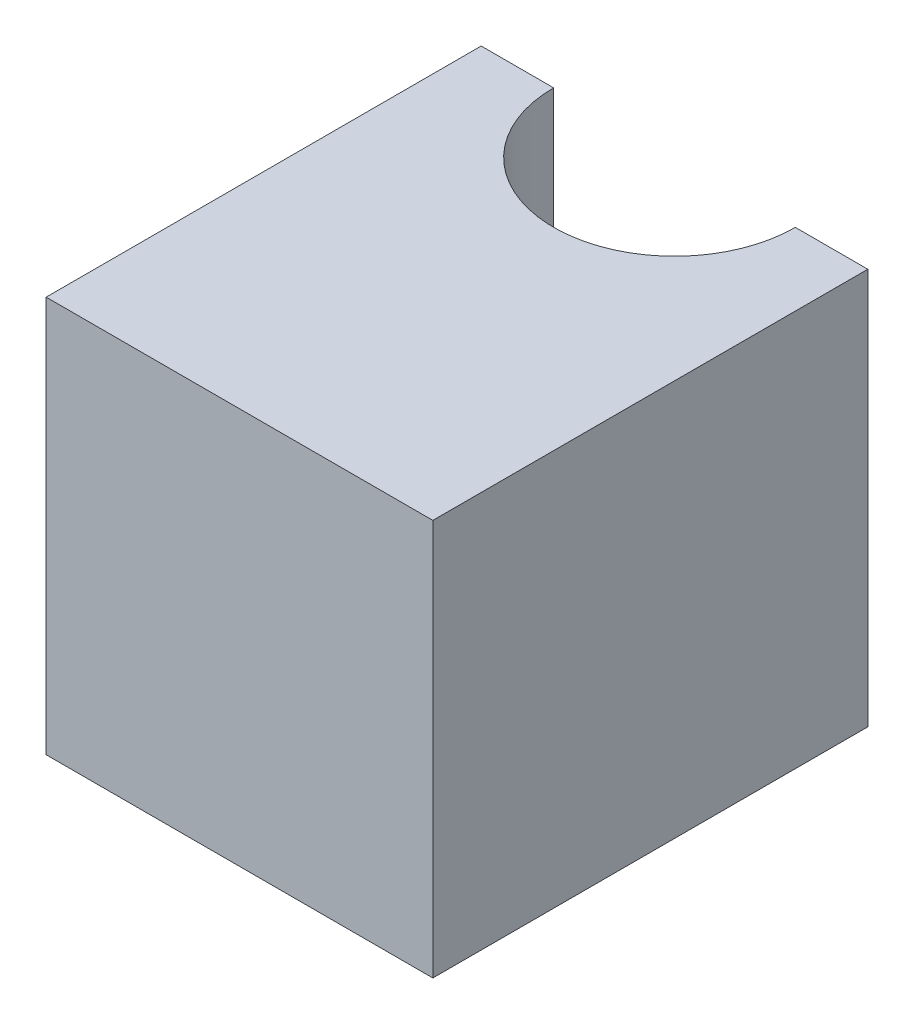
ISO-10303-21;
HEADER;
FILE_DESCRIPTION(('STEP AP214'),'2;1');
FILE_NAME('part.step','',(''),(''),'','','');
FILE_SCHEMA(('AUTOMOTIVE_DESIGN { 1 0 10303 214 1 1 1 1 }'));
ENDSEC;
DATA;
#1=APPLICATION_CONTEXT('core data for automotive mechanical design processes');
#2=APPLICATION_PROTOCOL_DEFINITION('international standard','automotive_design',2000,#1);
#3=PRODUCT_CONTEXT('',#1,'mechanical');
#4=PRODUCT('Part','Part','',(#3));
#5=PRODUCT_RELATED_PRODUCT_CATEGORY('part','',(#4));
#6=PRODUCT_DEFINITION_FORMATION('','',#4);
#7=PRODUCT_DEFINITION_CONTEXT('part definition',#1,'design');
#8=PRODUCT_DEFINITION('design','',#6,#7);
#9=PRODUCT_DEFINITION_SHAPE('','',#8);
#10=(LENGTH_UNIT() NAMED_UNIT(*) SI_UNIT(.MILLI.,.METRE.));
#11=(NAMED_UNIT(*) PLANE_ANGLE_UNIT() SI_UNIT($,.RADIAN.));
#12=(NAMED_UNIT(*) SI_UNIT($,.STERADIAN.) SOLID_ANGLE_UNIT());
#13=UNCERTAINTY_MEASURE_WITH_UNIT(LENGTH_MEASURE(1.E-05),#10,'distance_accuracy_value','');
#14=(GEOMETRIC_REPRESENTATION_CONTEXT(3) GLOBAL_UNCERTAINTY_ASSIGNED_CONTEXT((#13)) GLOBAL_UNIT_ASSIGNED_CONTEXT((#10,
#11,#12)) REPRESENTATION_CONTEXT('',''));
#15=CARTESIAN_POINT('',(0.,0.,0.));
#16=DIRECTION('',(0.,0.,1.));
#17=DIRECTION('',(1.,0.,0.));
#18=AXIS2_PLACEMENT_3D('',#15,#16,#17);
#19=CARTESIAN_POINT('',(-7.,0.,-6.1));
#20=DIRECTION('',(0.,1.,0.));
#21=DIRECTION('',(0.,0.,1.));
#22=AXIS2_PLACEMENT_3D('',#19,#20,#21);
#23=CYLINDRICAL_SURFACE('',#22,0.25);
#24=DIRECTION('',(0.,1.,0.));
#25=VECTOR('',#24,1.);
#26=CARTESIAN_POINT('',(-7.25,0.,-6.1));
#27=LINE('',#26,#25);
#28=CARTESIAN_POINT('',(-7.25,0.82,-6.1));
#29=VERTEX_POINT('',#28);
#30=CARTESIAN_POINT('',(-7.25,0.,-6.1));
#31=VERTEX_POINT('',#30);
#32=EDGE_CURVE('E119',#29,#31,#27,.F.);
#33=ORIENTED_EDGE('',*,*,#32,.F.);
#34=CARTESIAN_POINT('',(-7.,0.82,-6.1));
#35=DIRECTION('',(0.,1.,0.));
#36=DIRECTION('',(0.,0.,1.));
#37=AXIS2_PLACEMENT_3D('',#34,#35,#36);
#38=CIRCLE('',#37,0.25);
#39=CARTESIAN_POINT('',(-6.75,0.82,-6.1));
#40=VERTEX_POINT('',#39);
#41=EDGE_CURVE('E80',#40,#29,#38,.F.);
#42=ORIENTED_EDGE('',*,*,#41,.F.);
#43=DIRECTION('',(0.,1.,0.));
#44=VECTOR('',#43,1.);
#45=CARTESIAN_POINT('',(-6.75,0.,-6.1));
#46=LINE('',#45,#44);
#47=CARTESIAN_POINT('',(-6.75,0.,-6.1));
#48=VERTEX_POINT('',#47);
#49=EDGE_CURVE('E78',#48,#40,#46,.T.);
#50=ORIENTED_EDGE('',*,*,#49,.F.);
#51=CARTESIAN_POINT('',(-7.,0.,-6.1));
#52=DIRECTION('',(0.,1.,0.));
#53=DIRECTION('',(0.,0.,1.));
#54=AXIS2_PLACEMENT_3D('',#51,#52,#53);
#55=CIRCLE('',#54,0.25);
#56=EDGE_CURVE('E20',#48,#31,#55,.F.);
#57=ORIENTED_EDGE('',*,*,#56,.T.);
#58=EDGE_LOOP('',(#33,#42,#50,#57));
#59=FACE_BOUND('',#58,.T.);
#60=ADVANCED_FACE('F17',(#59),#23,.F.);
#61=CARTESIAN_POINT('',(-7.25,0.,-6.1));
#62=DIRECTION('',(0.,0.,-1.));
#63=DIRECTION('',(-1.,0.,0.));
#64=AXIS2_PLACEMENT_3D('',#61,#62,#63);
#65=PLANE('',#64);
#66=DIRECTION('',(1.,0.,0.));
#67=VECTOR('',#66,1.);
#68=CARTESIAN_POINT('',(-7.,0.82,-6.1));
#69=LINE('',#68,#67);
#70=CARTESIAN_POINT('',(-7.4,0.82,-6.1));
#71=VERTEX_POINT('',#70);
#72=EDGE_CURVE('E104',#29,#71,#69,.F.);
#73=ORIENTED_EDGE('',*,*,#72,.F.);
#74=ORIENTED_EDGE('',*,*,#32,.T.);
#75=DIRECTION('',(1.,0.,0.));
#76=VECTOR('',#75,1.);
#77=CARTESIAN_POINT('',(-7.,0.,-6.1));
#78=LINE('',#77,#76);
#79=CARTESIAN_POINT('',(-7.4,0.,-6.1));
#80=VERTEX_POINT('',#79);
#81=EDGE_CURVE('E73',#31,#80,#78,.F.);
#82=ORIENTED_EDGE('',*,*,#81,.T.);
#83=DIRECTION('',(0.,1.,0.));
#84=VECTOR('',#83,1.);
#85=CARTESIAN_POINT('',(-7.4,0.,-6.1));
#86=LINE('',#85,#84);
#87=EDGE_CURVE('E76',#71,#80,#86,.F.);
#88=ORIENTED_EDGE('',*,*,#87,.F.);
#89=EDGE_LOOP('',(#73,#74,#82,#88));
#90=FACE_BOUND('',#89,.T.);
#91=ADVANCED_FACE('F196',(#90),#65,.T.);
#92=CARTESIAN_POINT('',(-7.4,0.,-6.1));
#93=DIRECTION('',(-1.,0.,0.));
#94=DIRECTION('',(0.,0.,1.));
#95=AXIS2_PLACEMENT_3D('',#92,#93,#94);
#96=PLANE('',#95);
#97=DIRECTION('',(0.,0.,1.));
#98=VECTOR('',#97,1.);
#99=CARTESIAN_POINT('',(-7.4,0.82,-5.65));
#100=LINE('',#99,#98);
#101=CARTESIAN_POINT('',(-7.4,0.82,-5.2));
#102=VERTEX_POINT('',#101);
#103=EDGE_CURVE('E83',#71,#102,#100,.T.);
#104=ORIENTED_EDGE('',*,*,#103,.F.);
#105=ORIENTED_EDGE('',*,*,#87,.T.);
#106=DIRECTION('',(0.,0.,1.));
#107=VECTOR('',#106,1.);
#108=CARTESIAN_POINT('',(-7.4,0.,-5.65));
#109=LINE('',#108,#107);
#110=CARTESIAN_POINT('',(-7.4,0.,-5.2));
#111=VERTEX_POINT('',#110);
#112=EDGE_CURVE('E89',#80,#111,#109,.T.);
#113=ORIENTED_EDGE('',*,*,#112,.T.);
#114=DIRECTION('',(0.,1.,0.));
#115=VECTOR('',#114,1.);
#116=CARTESIAN_POINT('',(-7.4,0.,-5.2));
#117=LINE('',#116,#115);
#118=EDGE_CURVE('E100',#102,#111,#117,.F.);
#119=ORIENTED_EDGE('',*,*,#118,.F.);
#120=EDGE_LOOP('',(#104,#105,#113,#119));
#121=FACE_BOUND('',#120,.T.);
#122=ADVANCED_FACE('F187',(#121),#96,.T.);
#123=CARTESIAN_POINT('',(-7.,0.,-5.65));
#124=DIRECTION('',(0.,1.,0.));
#125=DIRECTION('',(0.,0.,1.));
#126=AXIS2_PLACEMENT_3D('',#123,#124,#125);
#127=PLANE('',#126);
#128=ORIENTED_EDGE('',*,*,#81,.F.);
#129=ORIENTED_EDGE('',*,*,#56,.F.);
#130=DIRECTION('',(-1.,0.,0.));
#131=VECTOR('',#130,1.);
#132=CARTESIAN_POINT('',(-6.6,0.,-6.1));
#133=LINE('',#132,#131);
#134=CARTESIAN_POINT('',(-6.6,0.,-6.1));
#135=VERTEX_POINT('',#134);
#136=EDGE_CURVE('E70',#135,#48,#133,.T.);
#137=ORIENTED_EDGE('',*,*,#136,.F.);
#138=DIRECTION('',(0.,0.,-1.));
#139=VECTOR('',#138,1.);
#140=CARTESIAN_POINT('',(-6.6,0.,-5.2));
#141=LINE('',#140,#139);
#142=CARTESIAN_POINT('',(-6.6,0.,-5.2));
#143=VERTEX_POINT('',#142);
#144=EDGE_CURVE('E98',#143,#135,#141,.T.);
#145=ORIENTED_EDGE('',*,*,#144,.F.);
#146=DIRECTION('',(1.,0.,0.));
#147=VECTOR('',#146,1.);
#148=CARTESIAN_POINT('',(-7.4,0.,-5.2));
#149=LINE('',#148,#147);
#150=EDGE_CURVE('E107',#111,#143,#149,.T.);
#151=ORIENTED_EDGE('',*,*,#150,.F.);
#152=ORIENTED_EDGE('',*,*,#112,.F.);
#153=EDGE_LOOP('',(#128,#129,#137,#145,#151,#152));
#154=FACE_BOUND('',#153,.T.);
#155=ADVANCED_FACE('F68',(#154),#127,.F.);
#156=CARTESIAN_POINT('',(-6.6,0.,-6.1));
#157=DIRECTION('',(0.,0.,-1.));
#158=DIRECTION('',(-1.,0.,0.));
#159=AXIS2_PLACEMENT_3D('',#156,#157,#158);
#160=PLANE('',#159);
#161=DIRECTION('',(1.,0.,0.));
#162=VECTOR('',#161,1.);
#163=CARTESIAN_POINT('',(-7.,0.82,-6.1));
#164=LINE('',#163,#162);
#165=CARTESIAN_POINT('',(-6.6,0.82,-6.1));
#166=VERTEX_POINT('',#165);
#167=EDGE_CURVE('E105',#166,#40,#164,.F.);
#168=ORIENTED_EDGE('',*,*,#167,.F.);
#169=DIRECTION('',(0.,1.,0.));
#170=VECTOR('',#169,1.);
#171=CARTESIAN_POINT('',(-6.6,0.,-6.1));
#172=LINE('',#171,#170);
#173=EDGE_CURVE('E87',#135,#166,#172,.T.);
#174=ORIENTED_EDGE('',*,*,#173,.F.);
#175=ORIENTED_EDGE('',*,*,#136,.T.);
#176=ORIENTED_EDGE('',*,*,#49,.T.);
#177=EDGE_LOOP('',(#168,#174,#175,#176));
#178=FACE_BOUND('',#177,.T.);
#179=ADVANCED_FACE('F85',(#178),#160,.T.);
#180=CARTESIAN_POINT('',(-7.,0.82,-5.65));
#181=DIRECTION('',(0.,1.,0.));
#182=DIRECTION('',(0.,0.,1.));
#183=AXIS2_PLACEMENT_3D('',#180,#181,#182);
#184=PLANE('',#183);
#185=ORIENTED_EDGE('',*,*,#41,.T.);
#186=ORIENTED_EDGE('',*,*,#72,.T.);
#187=ORIENTED_EDGE('',*,*,#103,.T.);
#188=DIRECTION('',(1.,0.,0.));
#189=VECTOR('',#188,1.);
#190=CARTESIAN_POINT('',(-7.4,0.82,-5.2));
#191=LINE('',#190,#189);
#192=CARTESIAN_POINT('',(-6.6,0.82,-5.2));
#193=VERTEX_POINT('',#192);
#194=EDGE_CURVE('E35',#193,#102,#191,.F.);
#195=ORIENTED_EDGE('',*,*,#194,.F.);
#196=DIRECTION('',(0.,0.,-1.));
#197=VECTOR('',#196,1.);
#198=CARTESIAN_POINT('',(-6.6,0.82,-5.2));
#199=LINE('',#198,#197);
#200=EDGE_CURVE('E26',#166,#193,#199,.F.);
#201=ORIENTED_EDGE('',*,*,#200,.F.);
#202=ORIENTED_EDGE('',*,*,#167,.T.);
#203=EDGE_LOOP('',(#185,#186,#187,#195,#201,#202));
#204=FACE_BOUND('',#203,.T.);
#205=ADVANCED_FACE('F145',(#204),#184,.T.);
#206=CARTESIAN_POINT('',(-7.4,0.,-5.2));
#207=DIRECTION('',(0.,0.,1.));
#208=DIRECTION('',(1.,0.,0.));
#209=AXIS2_PLACEMENT_3D('',#206,#207,#208);
#210=PLANE('',#209);
#211=ORIENTED_EDGE('',*,*,#194,.T.);
#212=ORIENTED_EDGE('',*,*,#118,.T.);
#213=ORIENTED_EDGE('',*,*,#150,.T.);
#214=DIRECTION('',(0.,1.,0.));
#215=VECTOR('',#214,1.);
#216=CARTESIAN_POINT('',(-6.6,0.,-5.2));
#217=LINE('',#216,#215);
#218=EDGE_CURVE('E11',#193,#143,#217,.F.);
#219=ORIENTED_EDGE('',*,*,#218,.F.);
#220=EDGE_LOOP('',(#211,#212,#213,#219));
#221=FACE_BOUND('',#220,.T.);
#222=ADVANCED_FACE('F141',(#221),#210,.T.);
#223=CARTESIAN_POINT('',(-6.6,0.,-5.2));
#224=DIRECTION('',(1.,0.,0.));
#225=DIRECTION('',(0.,0.,-1.));
#226=AXIS2_PLACEMENT_3D('',#223,#224,#225);
#227=PLANE('',#226);
#228=ORIENTED_EDGE('',*,*,#200,.T.);
#229=ORIENTED_EDGE('',*,*,#218,.T.);
#230=ORIENTED_EDGE('',*,*,#144,.T.);
#231=ORIENTED_EDGE('',*,*,#173,.T.);
#232=EDGE_LOOP('',(#228,#229,#230,#231));
#233=FACE_BOUND('',#232,.T.);
#234=ADVANCED_FACE('F144',(#233),#227,.T.);
#235=CLOSED_SHELL('',(#60,#91,#122,#155,#179,#205,#222,#234));
#236=MANIFOLD_SOLID_BREP('B1',#235);
#237=ADVANCED_BREP_SHAPE_REPRESENTATION('',(#18,#236),#14);
#238=SHAPE_DEFINITION_REPRESENTATION(#9,#237);
ENDSEC;
END-ISO-10303-21;
